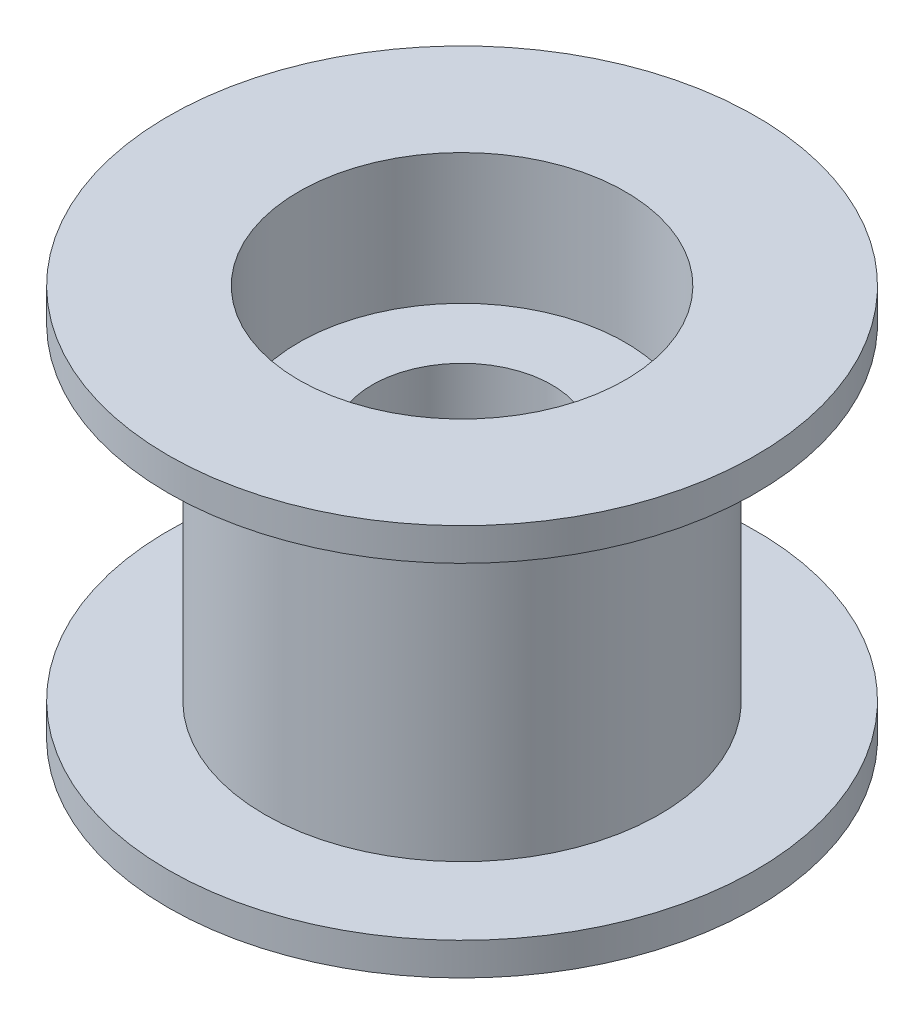
ISO-10303-21;
HEADER;
FILE_DESCRIPTION(('STEP AP214'),'2;1');
FILE_NAME('part.step','',(''),(''),'','','');
FILE_SCHEMA(('AUTOMOTIVE_DESIGN { 1 0 10303 214 1 1 1 1 }'));
ENDSEC;
DATA;
#1=APPLICATION_CONTEXT('core data for automotive mechanical design processes');
#2=APPLICATION_PROTOCOL_DEFINITION('international standard','automotive_design',2000,#1);
#3=PRODUCT_CONTEXT('',#1,'mechanical');
#4=PRODUCT('Part','Part','',(#3));
#5=PRODUCT_RELATED_PRODUCT_CATEGORY('part','',(#4));
#6=PRODUCT_DEFINITION_FORMATION('','',#4);
#7=PRODUCT_DEFINITION_CONTEXT('part definition',#1,'design');
#8=PRODUCT_DEFINITION('design','',#6,#7);
#9=PRODUCT_DEFINITION_SHAPE('','',#8);
#10=(LENGTH_UNIT() NAMED_UNIT(*) SI_UNIT(.MILLI.,.METRE.));
#11=(NAMED_UNIT(*) PLANE_ANGLE_UNIT() SI_UNIT($,.RADIAN.));
#12=(NAMED_UNIT(*) SI_UNIT($,.STERADIAN.) SOLID_ANGLE_UNIT());
#13=UNCERTAINTY_MEASURE_WITH_UNIT(LENGTH_MEASURE(1.E-05),#10,'distance_accuracy_value','');
#14=(GEOMETRIC_REPRESENTATION_CONTEXT(3) GLOBAL_UNCERTAINTY_ASSIGNED_CONTEXT((#13)) GLOBAL_UNIT_ASSIGNED_CONTEXT((#10,
#11,#12)) REPRESENTATION_CONTEXT('',''));
#15=CARTESIAN_POINT('',(0.,0.,0.));
#16=DIRECTION('',(0.,0.,1.));
#17=DIRECTION('',(1.,0.,0.));
#18=AXIS2_PLACEMENT_3D('',#15,#16,#17);
#19=CARTESIAN_POINT('',(0.,6.,0.));
#20=DIRECTION('',(0.,1.,0.));
#21=DIRECTION('',(0.,0.,1.));
#22=AXIS2_PLACEMENT_3D('',#19,#20,#21);
#23=CYLINDRICAL_SURFACE('',#22,6.05);
#24=CARTESIAN_POINT('',(0.,-5.,0.));
#25=DIRECTION('',(0.,1.,0.));
#26=DIRECTION('',(0.,0.,1.));
#27=AXIS2_PLACEMENT_3D('',#24,#25,#26);
#28=CIRCLE('',#27,6.05);
#29=CARTESIAN_POINT('',(0.,-5.,6.05));
#30=VERTEX_POINT('',#29);
#31=EDGE_CURVE('E10',#30,#30,#28,.T.);
#32=ORIENTED_EDGE('',*,*,#31,.T.);
#33=EDGE_LOOP('',(#32));
#34=FACE_BOUND('',#33,.T.);
#35=CARTESIAN_POINT('',(0.,5.,0.));
#36=DIRECTION('',(0.,1.,0.));
#37=DIRECTION('',(0.,0.,1.));
#38=AXIS2_PLACEMENT_3D('',#35,#36,#37);
#39=CIRCLE('',#38,6.05);
#40=CARTESIAN_POINT('',(0.,5.,6.05));
#41=VERTEX_POINT('',#40);
#42=EDGE_CURVE('E71',#41,#41,#39,.T.);
#43=ORIENTED_EDGE('',*,*,#42,.F.);
#44=EDGE_LOOP('',(#43));
#45=FACE_BOUND('',#44,.T.);
#46=ADVANCED_FACE('F31',(#34,#45),#23,.T.);
#47=CARTESIAN_POINT('',(-9.,-5.,0.));
#48=DIRECTION('',(0.,1.,0.));
#49=DIRECTION('',(0.,0.,1.));
#50=AXIS2_PLACEMENT_3D('',#47,#48,#49);
#51=PLANE('',#50);
#52=CARTESIAN_POINT('',(0.,-5.,0.));
#53=DIRECTION('',(0.,1.,0.));
#54=DIRECTION('',(0.,0.,1.));
#55=AXIS2_PLACEMENT_3D('',#52,#53,#54);
#56=CIRCLE('',#55,9.);
#57=CARTESIAN_POINT('',(0.,-5.,9.));
#58=VERTEX_POINT('',#57);
#59=EDGE_CURVE('E37',#58,#58,#56,.T.);
#60=ORIENTED_EDGE('',*,*,#59,.T.);
#61=EDGE_LOOP('',(#60));
#62=FACE_BOUND('',#61,.T.);
#63=ORIENTED_EDGE('',*,*,#31,.F.);
#64=EDGE_LOOP('',(#63));
#65=FACE_BOUND('',#64,.T.);
#66=ADVANCED_FACE('F79',(#62,#65),#51,.T.);
#67=CARTESIAN_POINT('',(0.,6.,0.));
#68=DIRECTION('',(0.,1.,0.));
#69=DIRECTION('',(0.,0.,1.));
#70=AXIS2_PLACEMENT_3D('',#67,#68,#69);
#71=CYLINDRICAL_SURFACE('',#70,9.);
#72=CARTESIAN_POINT('',(0.,-6.,0.));
#73=DIRECTION('',(0.,1.,0.));
#74=DIRECTION('',(0.,0.,1.));
#75=AXIS2_PLACEMENT_3D('',#72,#73,#74);
#76=CIRCLE('',#75,9.);
#77=CARTESIAN_POINT('',(0.,-6.,9.));
#78=VERTEX_POINT('',#77);
#79=EDGE_CURVE('E41',#78,#78,#76,.T.);
#80=ORIENTED_EDGE('',*,*,#79,.T.);
#81=EDGE_LOOP('',(#80));
#82=FACE_BOUND('',#81,.T.);
#83=ORIENTED_EDGE('',*,*,#59,.F.);
#84=EDGE_LOOP('',(#83));
#85=FACE_BOUND('',#84,.T.);
#86=ADVANCED_FACE('F83',(#82,#85),#71,.T.);
#87=CARTESIAN_POINT('',(-5.,-6.,0.));
#88=DIRECTION('',(0.,-1.,0.));
#89=DIRECTION('',(0.,0.,-1.));
#90=AXIS2_PLACEMENT_3D('',#87,#88,#89);
#91=PLANE('',#90);
#92=CARTESIAN_POINT('',(0.,-6.,0.));
#93=DIRECTION('',(0.,1.,0.));
#94=DIRECTION('',(0.,0.,1.));
#95=AXIS2_PLACEMENT_3D('',#92,#93,#94);
#96=CIRCLE('',#95,5.);
#97=CARTESIAN_POINT('',(0.,-6.,5.));
#98=VERTEX_POINT('',#97);
#99=EDGE_CURVE('E45',#98,#98,#96,.T.);
#100=ORIENTED_EDGE('',*,*,#99,.T.);
#101=EDGE_LOOP('',(#100));
#102=FACE_BOUND('',#101,.T.);
#103=ORIENTED_EDGE('',*,*,#79,.F.);
#104=EDGE_LOOP('',(#103));
#105=FACE_BOUND('',#104,.T.);
#106=ADVANCED_FACE('F87',(#102,#105),#91,.T.);
#107=CARTESIAN_POINT('',(0.,6.,0.));
#108=DIRECTION('',(0.,1.,0.));
#109=DIRECTION('',(0.,0.,1.));
#110=AXIS2_PLACEMENT_3D('',#107,#108,#109);
#111=CYLINDRICAL_SURFACE('',#110,5.);
#112=CARTESIAN_POINT('',(0.,-2.,0.));
#113=DIRECTION('',(0.,1.,0.));
#114=DIRECTION('',(0.,0.,1.));
#115=AXIS2_PLACEMENT_3D('',#112,#113,#114);
#116=CIRCLE('',#115,5.);
#117=CARTESIAN_POINT('',(0.,-2.,5.));
#118=VERTEX_POINT('',#117);
#119=EDGE_CURVE('E50',#118,#118,#116,.T.);
#120=ORIENTED_EDGE('',*,*,#119,.T.);
#121=EDGE_LOOP('',(#120));
#122=FACE_BOUND('',#121,.T.);
#123=ORIENTED_EDGE('',*,*,#99,.F.);
#124=EDGE_LOOP('',(#123));
#125=FACE_BOUND('',#124,.T.);
#126=ADVANCED_FACE('F94',(#122,#125),#111,.F.);
#127=CARTESIAN_POINT('',(-5.,-2.,0.));
#128=DIRECTION('',(0.,-1.,0.));
#129=DIRECTION('',(0.,0.,-1.));
#130=AXIS2_PLACEMENT_3D('',#127,#128,#129);
#131=PLANE('',#130);
#132=CARTESIAN_POINT('',(0.,-2.,0.));
#133=DIRECTION('',(0.,1.,0.));
#134=DIRECTION('',(0.,0.,1.));
#135=AXIS2_PLACEMENT_3D('',#132,#133,#134);
#136=CIRCLE('',#135,2.75);
#137=CARTESIAN_POINT('',(0.,-2.,2.75));
#138=VERTEX_POINT('',#137);
#139=EDGE_CURVE('E53',#138,#138,#136,.T.);
#140=ORIENTED_EDGE('',*,*,#139,.T.);
#141=EDGE_LOOP('',(#140));
#142=FACE_BOUND('',#141,.T.);
#143=ORIENTED_EDGE('',*,*,#119,.F.);
#144=EDGE_LOOP('',(#143));
#145=FACE_BOUND('',#144,.T.);
#146=ADVANCED_FACE('F98',(#142,#145),#131,.T.);
#147=CARTESIAN_POINT('',(0.,6.,0.));
#148=DIRECTION('',(0.,1.,0.));
#149=DIRECTION('',(0.,0.,1.));
#150=AXIS2_PLACEMENT_3D('',#147,#148,#149);
#151=CYLINDRICAL_SURFACE('',#150,2.75);
#152=CARTESIAN_POINT('',(0.,2.,0.));
#153=DIRECTION('',(0.,1.,0.));
#154=DIRECTION('',(0.,0.,1.));
#155=AXIS2_PLACEMENT_3D('',#152,#153,#154);
#156=CIRCLE('',#155,2.75);
#157=CARTESIAN_POINT('',(0.,2.,2.75));
#158=VERTEX_POINT('',#157);
#159=EDGE_CURVE('E56',#158,#158,#156,.T.);
#160=ORIENTED_EDGE('',*,*,#159,.T.);
#161=EDGE_LOOP('',(#160));
#162=FACE_BOUND('',#161,.T.);
#163=ORIENTED_EDGE('',*,*,#139,.F.);
#164=EDGE_LOOP('',(#163));
#165=FACE_BOUND('',#164,.T.);
#166=ADVANCED_FACE('F102',(#162,#165),#151,.F.);
#167=CARTESIAN_POINT('',(-5.,2.,0.));
#168=DIRECTION('',(0.,1.,0.));
#169=DIRECTION('',(0.,0.,1.));
#170=AXIS2_PLACEMENT_3D('',#167,#168,#169);
#171=PLANE('',#170);
#172=CARTESIAN_POINT('',(0.,2.,0.));
#173=DIRECTION('',(0.,1.,0.));
#174=DIRECTION('',(0.,0.,1.));
#175=AXIS2_PLACEMENT_3D('',#172,#173,#174);
#176=CIRCLE('',#175,5.);
#177=CARTESIAN_POINT('',(0.,2.,5.));
#178=VERTEX_POINT('',#177);
#179=EDGE_CURVE('E59',#178,#178,#176,.T.);
#180=ORIENTED_EDGE('',*,*,#179,.T.);
#181=EDGE_LOOP('',(#180));
#182=FACE_BOUND('',#181,.T.);
#183=ORIENTED_EDGE('',*,*,#159,.F.);
#184=EDGE_LOOP('',(#183));
#185=FACE_BOUND('',#184,.T.);
#186=ADVANCED_FACE('F106',(#182,#185),#171,.T.);
#187=CARTESIAN_POINT('',(0.,6.,0.));
#188=DIRECTION('',(0.,1.,0.));
#189=DIRECTION('',(0.,0.,1.));
#190=AXIS2_PLACEMENT_3D('',#187,#188,#189);
#191=CYLINDRICAL_SURFACE('',#190,5.);
#192=CARTESIAN_POINT('',(0.,6.,0.));
#193=DIRECTION('',(0.,1.,0.));
#194=DIRECTION('',(0.,0.,1.));
#195=AXIS2_PLACEMENT_3D('',#192,#193,#194);
#196=CIRCLE('',#195,5.);
#197=CARTESIAN_POINT('',(0.,6.,5.));
#198=VERTEX_POINT('',#197);
#199=EDGE_CURVE('E62',#198,#198,#196,.T.);
#200=ORIENTED_EDGE('',*,*,#199,.T.);
#201=EDGE_LOOP('',(#200));
#202=FACE_BOUND('',#201,.T.);
#203=ORIENTED_EDGE('',*,*,#179,.F.);
#204=EDGE_LOOP('',(#203));
#205=FACE_BOUND('',#204,.T.);
#206=ADVANCED_FACE('F110',(#202,#205),#191,.F.);
#207=CARTESIAN_POINT('',(-5.,6.,0.));
#208=DIRECTION('',(0.,1.,0.));
#209=DIRECTION('',(0.,0.,1.));
#210=AXIS2_PLACEMENT_3D('',#207,#208,#209);
#211=PLANE('',#210);
#212=CARTESIAN_POINT('',(0.,6.,0.));
#213=DIRECTION('',(0.,1.,0.));
#214=DIRECTION('',(0.,0.,1.));
#215=AXIS2_PLACEMENT_3D('',#212,#213,#214);
#216=CIRCLE('',#215,9.);
#217=CARTESIAN_POINT('',(0.,6.,9.));
#218=VERTEX_POINT('',#217);
#219=EDGE_CURVE('E65',#218,#218,#216,.T.);
#220=ORIENTED_EDGE('',*,*,#219,.T.);
#221=EDGE_LOOP('',(#220));
#222=FACE_BOUND('',#221,.T.);
#223=ORIENTED_EDGE('',*,*,#199,.F.);
#224=EDGE_LOOP('',(#223));
#225=FACE_BOUND('',#224,.T.);
#226=ADVANCED_FACE('F114',(#222,#225),#211,.T.);
#227=CARTESIAN_POINT('',(0.,6.,0.));
#228=DIRECTION('',(0.,1.,0.));
#229=DIRECTION('',(0.,0.,1.));
#230=AXIS2_PLACEMENT_3D('',#227,#228,#229);
#231=CYLINDRICAL_SURFACE('',#230,9.);
#232=CARTESIAN_POINT('',(0.,5.,0.));
#233=DIRECTION('',(0.,1.,0.));
#234=DIRECTION('',(0.,0.,1.));
#235=AXIS2_PLACEMENT_3D('',#232,#233,#234);
#236=CIRCLE('',#235,9.);
#237=CARTESIAN_POINT('',(0.,5.,9.));
#238=VERTEX_POINT('',#237);
#239=EDGE_CURVE('E68',#238,#238,#236,.T.);
#240=ORIENTED_EDGE('',*,*,#239,.T.);
#241=EDGE_LOOP('',(#240));
#242=FACE_BOUND('',#241,.T.);
#243=ORIENTED_EDGE('',*,*,#219,.F.);
#244=EDGE_LOOP('',(#243));
#245=FACE_BOUND('',#244,.T.);
#246=ADVANCED_FACE('F118',(#242,#245),#231,.T.);
#247=CARTESIAN_POINT('',(-9.,5.,0.));
#248=DIRECTION('',(0.,-1.,0.));
#249=DIRECTION('',(0.,0.,-1.));
#250=AXIS2_PLACEMENT_3D('',#247,#248,#249);
#251=PLANE('',#250);
#252=ORIENTED_EDGE('',*,*,#42,.T.);
#253=EDGE_LOOP('',(#252));
#254=FACE_BOUND('',#253,.T.);
#255=ORIENTED_EDGE('',*,*,#239,.F.);
#256=EDGE_LOOP('',(#255));
#257=FACE_BOUND('',#256,.T.);
#258=ADVANCED_FACE('F75',(#254,#257),#251,.T.);
#259=CLOSED_SHELL('',(#46,#66,#86,#106,#126,#146,#166,#186,#206,#226,#246,#258));
#260=MANIFOLD_SOLID_BREP('B2',#259);
#261=ADVANCED_BREP_SHAPE_REPRESENTATION('',(#18,#260),#14);
#262=SHAPE_DEFINITION_REPRESENTATION(#9,#261);
ENDSEC;
END-ISO-10303-21;
